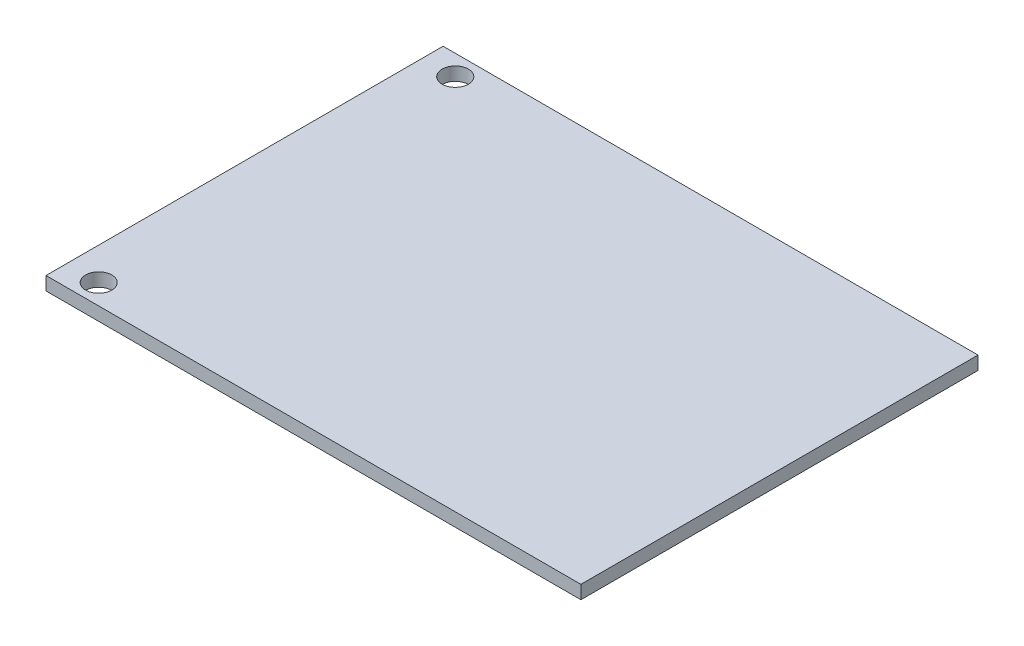
ISO-10303-21;
HEADER;
FILE_DESCRIPTION(('STEP AP214'),'2;1');
FILE_NAME('part.step','',(''),(''),'','','');
FILE_SCHEMA(('AUTOMOTIVE_DESIGN { 1 0 10303 214 1 1 1 1 }'));
ENDSEC;
DATA;
#1=APPLICATION_CONTEXT('core data for automotive mechanical design processes');
#2=APPLICATION_PROTOCOL_DEFINITION('international standard','automotive_design',2000,#1);
#3=PRODUCT_CONTEXT('',#1,'mechanical');
#4=PRODUCT('Part','Part','',(#3));
#5=PRODUCT_RELATED_PRODUCT_CATEGORY('part','',(#4));
#6=PRODUCT_DEFINITION_FORMATION('','',#4);
#7=PRODUCT_DEFINITION_CONTEXT('part definition',#1,'design');
#8=PRODUCT_DEFINITION('design','',#6,#7);
#9=PRODUCT_DEFINITION_SHAPE('','',#8);
#10=(LENGTH_UNIT() NAMED_UNIT(*) SI_UNIT(.MILLI.,.METRE.));
#11=(NAMED_UNIT(*) PLANE_ANGLE_UNIT() SI_UNIT($,.RADIAN.));
#12=(NAMED_UNIT(*) SI_UNIT($,.STERADIAN.) SOLID_ANGLE_UNIT());
#13=UNCERTAINTY_MEASURE_WITH_UNIT(LENGTH_MEASURE(1.E-05),#10,'distance_accuracy_value','');
#14=(GEOMETRIC_REPRESENTATION_CONTEXT(3) GLOBAL_UNCERTAINTY_ASSIGNED_CONTEXT((#13)) GLOBAL_UNIT_ASSIGNED_CONTEXT((#10,
#11,#12)) REPRESENTATION_CONTEXT('',''));
#15=CARTESIAN_POINT('',(0.,0.,0.));
#16=DIRECTION('',(0.,0.,1.));
#17=DIRECTION('',(1.,0.,0.));
#18=AXIS2_PLACEMENT_3D('',#15,#16,#17);
#19=CARTESIAN_POINT('',(33.,1.651,24.5));
#20=DIRECTION('',(-1.,0.,0.));
#21=DIRECTION('',(0.,0.,1.));
#22=AXIS2_PLACEMENT_3D('',#19,#20,#21);
#23=PLANE('',#22);
#24=DIRECTION('',(0.,0.,-1.));
#25=VECTOR('',#24,1.);
#26=CARTESIAN_POINT('',(33.,0.,24.5));
#27=LINE('',#26,#25);
#28=CARTESIAN_POINT('',(33.,0.,24.5));
#29=VERTEX_POINT('',#28);
#30=CARTESIAN_POINT('',(33.,0.,-24.5));
#31=VERTEX_POINT('',#30);
#32=EDGE_CURVE('E101',#29,#31,#27,.T.);
#33=ORIENTED_EDGE('',*,*,#32,.T.);
#34=DIRECTION('',(0.,-1.,0.));
#35=VECTOR('',#34,1.);
#36=CARTESIAN_POINT('',(33.,1.651,-24.5));
#37=LINE('',#36,#35);
#38=CARTESIAN_POINT('',(33.,1.651,-24.5));
#39=VERTEX_POINT('',#38);
#40=EDGE_CURVE('E11',#39,#31,#37,.T.);
#41=ORIENTED_EDGE('',*,*,#40,.F.);
#42=DIRECTION('',(0.,0.,-1.));
#43=VECTOR('',#42,1.);
#44=CARTESIAN_POINT('',(33.,1.651,24.5));
#45=LINE('',#44,#43);
#46=CARTESIAN_POINT('',(33.,1.651,24.5));
#47=VERTEX_POINT('',#46);
#48=EDGE_CURVE('E89',#47,#39,#45,.T.);
#49=ORIENTED_EDGE('',*,*,#48,.F.);
#50=DIRECTION('',(0.,-1.,0.));
#51=VECTOR('',#50,1.);
#52=CARTESIAN_POINT('',(33.,1.651,24.5));
#53=LINE('',#52,#51);
#54=EDGE_CURVE('E97',#47,#29,#53,.T.);
#55=ORIENTED_EDGE('',*,*,#54,.T.);
#56=EDGE_LOOP('',(#33,#41,#49,#55));
#57=FACE_BOUND('',#56,.T.);
#58=ADVANCED_FACE('F38',(#57),#23,.F.);
#59=CARTESIAN_POINT('',(-33.,1.651,-24.5));
#60=DIRECTION('',(0.,0.,1.));
#61=DIRECTION('',(1.,0.,0.));
#62=AXIS2_PLACEMENT_3D('',#59,#60,#61);
#63=PLANE('',#62);
#64=DIRECTION('',(-1.,0.,0.));
#65=VECTOR('',#64,1.);
#66=CARTESIAN_POINT('',(-33.,0.,-24.5));
#67=LINE('',#66,#65);
#68=CARTESIAN_POINT('',(-33.,0.,-24.5));
#69=VERTEX_POINT('',#68);
#70=EDGE_CURVE('E93',#31,#69,#67,.T.);
#71=ORIENTED_EDGE('',*,*,#70,.T.);
#72=DIRECTION('',(0.,-1.,0.));
#73=VECTOR('',#72,1.);
#74=CARTESIAN_POINT('',(-33.,1.651,-24.5));
#75=LINE('',#74,#73);
#76=CARTESIAN_POINT('',(-33.,1.651,-24.5));
#77=VERTEX_POINT('',#76);
#78=EDGE_CURVE('E46',#77,#69,#75,.T.);
#79=ORIENTED_EDGE('',*,*,#78,.F.);
#80=DIRECTION('',(-1.,0.,0.));
#81=VECTOR('',#80,1.);
#82=CARTESIAN_POINT('',(-33.,1.651,-24.5));
#83=LINE('',#82,#81);
#84=EDGE_CURVE('E84',#39,#77,#83,.T.);
#85=ORIENTED_EDGE('',*,*,#84,.F.);
#86=ORIENTED_EDGE('',*,*,#40,.T.);
#87=EDGE_LOOP('',(#71,#79,#85,#86));
#88=FACE_BOUND('',#87,.T.);
#89=ADVANCED_FACE('F92',(#88),#63,.F.);
#90=CARTESIAN_POINT('',(-33.,1.651,24.5));
#91=DIRECTION('',(1.,0.,0.));
#92=DIRECTION('',(0.,0.,-1.));
#93=AXIS2_PLACEMENT_3D('',#90,#91,#92);
#94=PLANE('',#93);
#95=DIRECTION('',(0.,0.,1.));
#96=VECTOR('',#95,1.);
#97=CARTESIAN_POINT('',(-33.,0.,24.5));
#98=LINE('',#97,#96);
#99=CARTESIAN_POINT('',(-33.,0.,24.5));
#100=VERTEX_POINT('',#99);
#101=EDGE_CURVE('E71',#69,#100,#98,.T.);
#102=ORIENTED_EDGE('',*,*,#101,.T.);
#103=DIRECTION('',(0.,-1.,0.));
#104=VECTOR('',#103,1.);
#105=CARTESIAN_POINT('',(-33.,1.651,24.5));
#106=LINE('',#105,#104);
#107=CARTESIAN_POINT('',(-33.,1.651,24.5));
#108=VERTEX_POINT('',#107);
#109=EDGE_CURVE('E94',#108,#100,#106,.T.);
#110=ORIENTED_EDGE('',*,*,#109,.F.);
#111=DIRECTION('',(0.,0.,1.));
#112=VECTOR('',#111,1.);
#113=CARTESIAN_POINT('',(-33.,1.651,24.5));
#114=LINE('',#113,#112);
#115=EDGE_CURVE('E87',#77,#108,#114,.T.);
#116=ORIENTED_EDGE('',*,*,#115,.F.);
#117=ORIENTED_EDGE('',*,*,#78,.T.);
#118=EDGE_LOOP('',(#102,#110,#116,#117));
#119=FACE_BOUND('',#118,.T.);
#120=ADVANCED_FACE('F95',(#119),#94,.F.);
#121=CARTESIAN_POINT('',(-33.,1.651,24.5));
#122=DIRECTION('',(0.,0.,-1.));
#123=DIRECTION('',(-1.,0.,0.));
#124=AXIS2_PLACEMENT_3D('',#121,#122,#123);
#125=PLANE('',#124);
#126=DIRECTION('',(1.,0.,0.));
#127=VECTOR('',#126,1.);
#128=CARTESIAN_POINT('',(-33.,0.,24.5));
#129=LINE('',#128,#127);
#130=EDGE_CURVE('E77',#100,#29,#129,.T.);
#131=ORIENTED_EDGE('',*,*,#130,.T.);
#132=ORIENTED_EDGE('',*,*,#54,.F.);
#133=DIRECTION('',(1.,0.,0.));
#134=VECTOR('',#133,1.);
#135=CARTESIAN_POINT('',(-33.,1.651,24.5));
#136=LINE('',#135,#134);
#137=EDGE_CURVE('E54',#108,#47,#136,.T.);
#138=ORIENTED_EDGE('',*,*,#137,.F.);
#139=ORIENTED_EDGE('',*,*,#109,.T.);
#140=EDGE_LOOP('',(#131,#132,#138,#139));
#141=FACE_BOUND('',#140,.T.);
#142=ADVANCED_FACE('F109',(#141),#125,.F.);
#143=CARTESIAN_POINT('',(0.,1.651,0.));
#144=DIRECTION('',(0.,-1.,0.));
#145=DIRECTION('',(0.,0.,-1.));
#146=AXIS2_PLACEMENT_3D('',#143,#144,#145);
#147=PLANE('',#146);
#148=CARTESIAN_POINT('',(-29.,1.651,-22.));
#149=DIRECTION('',(0.,1.,0.));
#150=DIRECTION('',(0.,0.,1.));
#151=AXIS2_PLACEMENT_3D('',#148,#149,#150);
#152=CIRCLE('',#151,1.62);
#153=CARTESIAN_POINT('',(-29.,1.651,-20.38));
#154=VERTEX_POINT('',#153);
#155=EDGE_CURVE('E121',#154,#154,#152,.T.);
#156=ORIENTED_EDGE('',*,*,#155,.F.);
#157=EDGE_LOOP('',(#156));
#158=FACE_BOUND('',#157,.T.);
#159=CARTESIAN_POINT('',(-29.,1.651,22.));
#160=DIRECTION('',(0.,1.,0.));
#161=DIRECTION('',(0.,0.,1.));
#162=AXIS2_PLACEMENT_3D('',#159,#160,#161);
#163=CIRCLE('',#162,1.62);
#164=CARTESIAN_POINT('',(-29.,1.651,23.62));
#165=VERTEX_POINT('',#164);
#166=EDGE_CURVE('E118',#165,#165,#163,.T.);
#167=ORIENTED_EDGE('',*,*,#166,.F.);
#168=EDGE_LOOP('',(#167));
#169=FACE_BOUND('',#168,.T.);
#170=ORIENTED_EDGE('',*,*,#48,.T.);
#171=ORIENTED_EDGE('',*,*,#84,.T.);
#172=ORIENTED_EDGE('',*,*,#115,.T.);
#173=ORIENTED_EDGE('',*,*,#137,.T.);
#174=EDGE_LOOP('',(#170,#171,#172,#173));
#175=FACE_BOUND('',#174,.T.);
#176=ADVANCED_FACE('F85',(#158,#169,#175),#147,.F.);
#177=CARTESIAN_POINT('',(0.,0.,0.));
#178=DIRECTION('',(0.,-1.,0.));
#179=DIRECTION('',(0.,0.,-1.));
#180=AXIS2_PLACEMENT_3D('',#177,#178,#179);
#181=PLANE('',#180);
#182=CARTESIAN_POINT('',(-29.,0.,-22.));
#183=DIRECTION('',(0.,1.,0.));
#184=DIRECTION('',(0.,0.,1.));
#185=AXIS2_PLACEMENT_3D('',#182,#183,#184);
#186=CIRCLE('',#185,1.62);
#187=CARTESIAN_POINT('',(-29.,0.,-20.38));
#188=VERTEX_POINT('',#187);
#189=EDGE_CURVE('E104',#188,#188,#186,.T.);
#190=ORIENTED_EDGE('',*,*,#189,.T.);
#191=EDGE_LOOP('',(#190));
#192=FACE_BOUND('',#191,.T.);
#193=CARTESIAN_POINT('',(-29.,0.,22.));
#194=DIRECTION('',(0.,1.,0.));
#195=DIRECTION('',(0.,0.,1.));
#196=AXIS2_PLACEMENT_3D('',#193,#194,#195);
#197=CIRCLE('',#196,1.62);
#198=CARTESIAN_POINT('',(-29.,0.,23.62));
#199=VERTEX_POINT('',#198);
#200=EDGE_CURVE('E115',#199,#199,#197,.T.);
#201=ORIENTED_EDGE('',*,*,#200,.T.);
#202=EDGE_LOOP('',(#201));
#203=FACE_BOUND('',#202,.T.);
#204=ORIENTED_EDGE('',*,*,#32,.F.);
#205=ORIENTED_EDGE('',*,*,#130,.F.);
#206=ORIENTED_EDGE('',*,*,#101,.F.);
#207=ORIENTED_EDGE('',*,*,#70,.F.);
#208=EDGE_LOOP('',(#204,#205,#206,#207));
#209=FACE_BOUND('',#208,.T.);
#210=ADVANCED_FACE('F112',(#192,#203,#209),#181,.T.);
#211=CARTESIAN_POINT('',(-29.,0.,22.));
#212=DIRECTION('',(0.,1.,0.));
#213=DIRECTION('',(0.,0.,1.));
#214=AXIS2_PLACEMENT_3D('',#211,#212,#213);
#215=CYLINDRICAL_SURFACE('',#214,1.62);
#216=ORIENTED_EDGE('',*,*,#200,.F.);
#217=EDGE_LOOP('',(#216));
#218=FACE_BOUND('',#217,.T.);
#219=ORIENTED_EDGE('',*,*,#166,.T.);
#220=EDGE_LOOP('',(#219));
#221=FACE_BOUND('',#220,.T.);
#222=ADVANCED_FACE('F132',(#218,#221),#215,.F.);
#223=CARTESIAN_POINT('',(-29.,0.,-22.));
#224=DIRECTION('',(0.,1.,0.));
#225=DIRECTION('',(0.,0.,1.));
#226=AXIS2_PLACEMENT_3D('',#223,#224,#225);
#227=CYLINDRICAL_SURFACE('',#226,1.62);
#228=ORIENTED_EDGE('',*,*,#189,.F.);
#229=EDGE_LOOP('',(#228));
#230=FACE_BOUND('',#229,.T.);
#231=ORIENTED_EDGE('',*,*,#155,.T.);
#232=EDGE_LOOP('',(#231));
#233=FACE_BOUND('',#232,.T.);
#234=ADVANCED_FACE('F129',(#230,#233),#227,.F.);
#235=CLOSED_SHELL('',(#58,#89,#120,#142,#176,#210,#222,#234));
#236=MANIFOLD_SOLID_BREP('B2',#235);
#237=ADVANCED_BREP_SHAPE_REPRESENTATION('',(#18,#236),#14);
#238=SHAPE_DEFINITION_REPRESENTATION(#9,#237);
ENDSEC;
END-ISO-10303-21;
